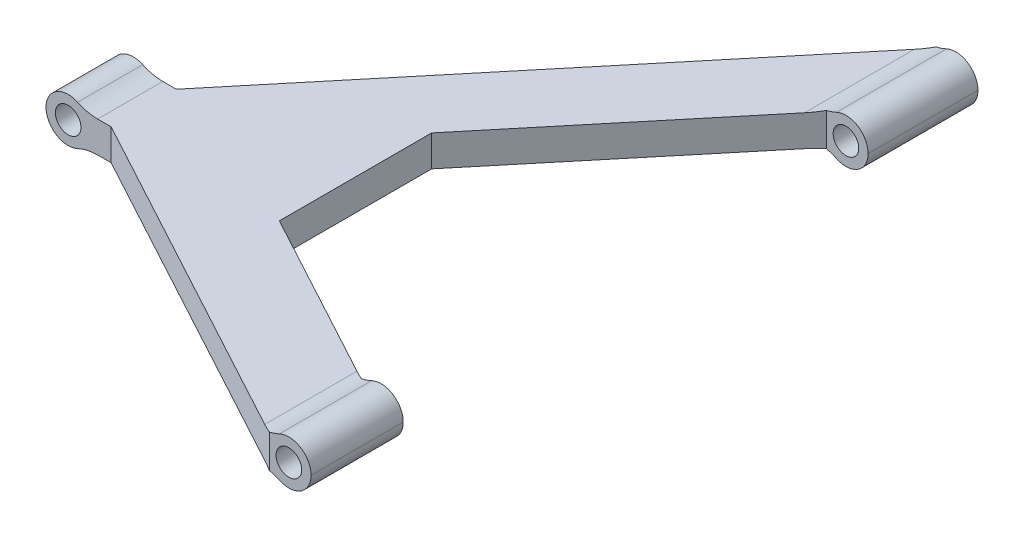
ISO-10303-21;
HEADER;
FILE_DESCRIPTION(('STEP AP214'),'2;1');
FILE_NAME('part.step','',(''),(''),'','','');
FILE_SCHEMA(('AUTOMOTIVE_DESIGN { 1 0 10303 214 1 1 1 1 }'));
ENDSEC;
DATA;
#1=APPLICATION_CONTEXT('core data for automotive mechanical design processes');
#2=APPLICATION_PROTOCOL_DEFINITION('international standard','automotive_design',2000,#1);
#3=PRODUCT_CONTEXT('',#1,'mechanical');
#4=PRODUCT('Part','Part','',(#3));
#5=PRODUCT_RELATED_PRODUCT_CATEGORY('part','',(#4));
#6=PRODUCT_DEFINITION_FORMATION('','',#4);
#7=PRODUCT_DEFINITION_CONTEXT('part definition',#1,'design');
#8=PRODUCT_DEFINITION('design','',#6,#7);
#9=PRODUCT_DEFINITION_SHAPE('','',#8);
#10=(LENGTH_UNIT() NAMED_UNIT(*) SI_UNIT(.MILLI.,.METRE.));
#11=(NAMED_UNIT(*) PLANE_ANGLE_UNIT() SI_UNIT($,.RADIAN.));
#12=(NAMED_UNIT(*) SI_UNIT($,.STERADIAN.) SOLID_ANGLE_UNIT());
#13=UNCERTAINTY_MEASURE_WITH_UNIT(LENGTH_MEASURE(1.E-05),#10,'distance_accuracy_value','');
#14=(GEOMETRIC_REPRESENTATION_CONTEXT(3) GLOBAL_UNCERTAINTY_ASSIGNED_CONTEXT((#13)) GLOBAL_UNIT_ASSIGNED_CONTEXT((#10,
#11,#12)) REPRESENTATION_CONTEXT('',''));
#15=CARTESIAN_POINT('',(0.,0.,0.));
#16=DIRECTION('',(0.,0.,1.));
#17=DIRECTION('',(1.,0.,0.));
#18=AXIS2_PLACEMENT_3D('',#15,#16,#17);
#19=CARTESIAN_POINT('',(0.,-2.38125,29.7610065716251));
#20=DIRECTION('',(0.,0.,1.));
#21=DIRECTION('',(1.,0.,0.));
#22=AXIS2_PLACEMENT_3D('',#19,#20,#21);
#23=PLANE('',#22);
#24=CARTESIAN_POINT('',(2.10785852839907,0.,29.7610065716251));
#25=DIRECTION('',(0.,0.,1.));
#26=DIRECTION('',(1.,0.,0.));
#27=AXIS2_PLACEMENT_3D('',#24,#25,#26);
#28=CIRCLE('',#27,2.38125);
#29=CARTESIAN_POINT('',(4.48910852839907,0.,29.7610065716251));
#30=VERTEX_POINT('',#29);
#31=CARTESIAN_POINT('',(1.09450968814982,2.15487254622298,29.7610065716251));
#32=VERTEX_POINT('',#31);
#33=EDGE_CURVE('E188',#30,#32,#28,.T.);
#34=ORIENTED_EDGE('',*,*,#33,.T.);
#35=CARTESIAN_POINT('',(-1.05999838574963,6.73640470440826,29.7610065716251));
#36=DIRECTION('',(0.,0.,1.));
#37=DIRECTION('',(-1.,0.,0.));
#38=AXIS2_PLACEMENT_3D('',#35,#36,#37);
#39=CIRCLE('',#38,5.06283931771331);
#40=CARTESIAN_POINT('',(0.,1.78577389821881,29.7610065716251));
#41=VERTEX_POINT('',#40);
#42=EDGE_CURVE('E193',#41,#32,#39,.T.);
#43=ORIENTED_EDGE('',*,*,#42,.F.);
#44=DIRECTION('',(0.,1.,0.));
#45=VECTOR('',#44,1.);
#46=CARTESIAN_POINT('',(0.,-2.38125,29.7610065716251));
#47=LINE('',#46,#45);
#48=CARTESIAN_POINT('',(0.,-1.78577389821882,29.7610065716251));
#49=VERTEX_POINT('',#48);
#50=EDGE_CURVE('E314',#49,#41,#47,.T.);
#51=ORIENTED_EDGE('',*,*,#50,.F.);
#52=CARTESIAN_POINT('',(-1.05999838574963,-6.73640470440826,29.7610065716251));
#53=DIRECTION('',(0.,0.,1.));
#54=DIRECTION('',(1.,0.,0.));
#55=AXIS2_PLACEMENT_3D('',#52,#53,#54);
#56=CIRCLE('',#55,5.06283931771331);
#57=CARTESIAN_POINT('',(1.09450968814982,-2.15487254622298,29.7610065716251));
#58=VERTEX_POINT('',#57);
#59=EDGE_CURVE('E253',#58,#49,#56,.T.);
#60=ORIENTED_EDGE('',*,*,#59,.F.);
#61=CARTESIAN_POINT('',(2.10785852839907,0.,29.7610065716251));
#62=DIRECTION('',(0.,0.,1.));
#63=DIRECTION('',(1.,0.,0.));
#64=AXIS2_PLACEMENT_3D('',#61,#62,#63);
#65=CIRCLE('',#64,2.38125);
#66=EDGE_CURVE('E196',#58,#30,#65,.T.);
#67=ORIENTED_EDGE('',*,*,#66,.T.);
#68=EDGE_LOOP('',(#34,#43,#51,#60,#67));
#69=FACE_BOUND('',#68,.T.);
#70=CARTESIAN_POINT('',(2.10785852839906,0.,29.7610065716251));
#71=DIRECTION('',(0.,0.,1.));
#72=DIRECTION('',(1.,0.,0.));
#73=AXIS2_PLACEMENT_3D('',#70,#71,#72);
#74=CIRCLE('',#73,1.375);
#75=CARTESIAN_POINT('',(3.48285852839906,0.,29.7610065716251));
#76=VERTEX_POINT('',#75);
#77=EDGE_CURVE('E298',#76,#76,#74,.T.);
#78=ORIENTED_EDGE('',*,*,#77,.F.);
#79=EDGE_LOOP('',(#78));
#80=FACE_BOUND('',#79,.T.);
#81=ADVANCED_FACE('F33',(#69,#80),#23,.T.);
#82=CARTESIAN_POINT('',(-37.,-2.38125,9.75000000000001));
#83=DIRECTION('',(-0.475719514626919,0.,0.879597034671632));
#84=DIRECTION('',(0.879597034671632,0.,0.475719514626919));
#85=AXIS2_PLACEMENT_3D('',#82,#83,#84);
#86=PLANE('',#85);
#87=CARTESIAN_POINT('',(-1.05999838574963,6.73640470440826,29.1877191482968));
#88=DIRECTION('',(-0.475719514626919,0.,0.879597034671632));
#89=DIRECTION('',(0.879597034671632,0.,0.475719514626919));
#90=AXIS2_PLACEMENT_3D('',#87,#88,#89);
#91=ELLIPSE('',#90,5.75586219387762,5.06283931771331);
#92=CARTESIAN_POINT('',(-1.05999838574962,1.67356538669495,29.1877191482968));
#93=VERTEX_POINT('',#92);
#94=EDGE_CURVE('E214',#93,#41,#91,.T.);
#95=ORIENTED_EDGE('',*,*,#94,.F.);
#96=DIRECTION('',(0.879597034671632,0.,0.475719514626919));
#97=VECTOR('',#96,1.);
#98=CARTESIAN_POINT('',(-37.,1.67356538669495,9.75000000000001));
#99=LINE('',#98,#97);
#100=CARTESIAN_POINT('',(-37.,1.67356538669495,9.75000000000001));
#101=VERTEX_POINT('',#100);
#102=EDGE_CURVE('E249',#101,#93,#99,.T.);
#103=ORIENTED_EDGE('',*,*,#102,.F.);
#104=DIRECTION('',(0.,1.,0.));
#105=VECTOR('',#104,1.);
#106=CARTESIAN_POINT('',(-37.,-2.38125,9.75000000000001));
#107=LINE('',#106,#105);
#108=CARTESIAN_POINT('',(-37.,-1.67356538669495,9.75000000000001));
#109=VERTEX_POINT('',#108);
#110=EDGE_CURVE('E317',#109,#101,#107,.T.);
#111=ORIENTED_EDGE('',*,*,#110,.F.);
#112=DIRECTION('',(-0.879597034671632,0.,-0.475719514626919));
#113=VECTOR('',#112,1.);
#114=CARTESIAN_POINT('',(-37.,-1.67356538669495,9.75000000000001));
#115=LINE('',#114,#113);
#116=CARTESIAN_POINT('',(-1.05999838574963,-1.67356538669495,29.1877191482968));
#117=VERTEX_POINT('',#116);
#118=EDGE_CURVE('E292',#117,#109,#115,.T.);
#119=ORIENTED_EDGE('',*,*,#118,.F.);
#120=CARTESIAN_POINT('',(-1.05999838574963,-6.73640470440826,29.1877191482968));
#121=DIRECTION('',(-0.475719514626919,0.,0.879597034671632));
#122=DIRECTION('',(0.879597034671632,0.,0.475719514626919));
#123=AXIS2_PLACEMENT_3D('',#120,#121,#122);
#124=ELLIPSE('',#123,5.75586219387762,5.06283931771331);
#125=EDGE_CURVE('E280',#49,#117,#124,.T.);
#126=ORIENTED_EDGE('',*,*,#125,.F.);
#127=ORIENTED_EDGE('',*,*,#50,.T.);
#128=EDGE_LOOP('',(#95,#103,#111,#119,#126,#127));
#129=FACE_BOUND('',#128,.T.);
#130=ADVANCED_FACE('F398',(#129),#86,.T.);
#131=CARTESIAN_POINT('',(-44.,-2.38125,9.75000000000001));
#132=DIRECTION('',(0.,0.,1.));
#133=DIRECTION('',(1.,0.,0.));
#134=AXIS2_PLACEMENT_3D('',#131,#132,#133);
#135=PLANE('',#134);
#136=DIRECTION('',(1.,0.,0.));
#137=VECTOR('',#136,1.);
#138=CARTESIAN_POINT('',(-44.,1.67356538669495,9.75000000000001));
#139=LINE('',#138,#137);
#140=CARTESIAN_POINT('',(-38.4508930858513,1.67356538669495,9.75000000000001));
#141=VERTEX_POINT('',#140);
#142=EDGE_CURVE('E247',#141,#101,#139,.T.);
#143=ORIENTED_EDGE('',*,*,#142,.F.);
#144=CARTESIAN_POINT('',(-38.4508930858513,6.73640470440826,9.75000000000001));
#145=DIRECTION('',(0.,0.,1.));
#146=DIRECTION('',(1.,0.,0.));
#147=AXIS2_PLACEMENT_3D('',#144,#145,#146);
#148=CIRCLE('',#147,5.06283931771331);
#149=CARTESIAN_POINT('',(-40.6054011597508,2.15487254622298,9.75000000000001));
#150=VERTEX_POINT('',#149);
#151=EDGE_CURVE('E251',#150,#141,#148,.T.);
#152=ORIENTED_EDGE('',*,*,#151,.F.);
#153=CARTESIAN_POINT('',(-41.61875,0.,9.75000000000001));
#154=DIRECTION('',(0.,0.,1.));
#155=DIRECTION('',(1.,0.,0.));
#156=AXIS2_PLACEMENT_3D('',#153,#154,#155);
#157=CIRCLE('',#156,2.38125);
#158=CARTESIAN_POINT('',(-44.,0.,9.75000000000001));
#159=VERTEX_POINT('',#158);
#160=EDGE_CURVE('E56',#150,#159,#157,.T.);
#161=ORIENTED_EDGE('',*,*,#160,.T.);
#162=CARTESIAN_POINT('',(-41.61875,0.,9.75000000000001));
#163=DIRECTION('',(0.,0.,1.));
#164=DIRECTION('',(1.,0.,0.));
#165=AXIS2_PLACEMENT_3D('',#162,#163,#164);
#166=CIRCLE('',#165,2.38125);
#167=CARTESIAN_POINT('',(-40.6054011597508,-2.15487254622298,9.75000000000001));
#168=VERTEX_POINT('',#167);
#169=EDGE_CURVE('E352',#159,#168,#166,.T.);
#170=ORIENTED_EDGE('',*,*,#169,.T.);
#171=CARTESIAN_POINT('',(-38.4508930858513,-6.73640470440826,9.75000000000001));
#172=DIRECTION('',(0.,0.,1.));
#173=DIRECTION('',(1.,0.,0.));
#174=AXIS2_PLACEMENT_3D('',#171,#172,#173);
#175=CIRCLE('',#174,5.06283931771331);
#176=CARTESIAN_POINT('',(-38.4508930858513,-1.67356538669495,9.75000000000001));
#177=VERTEX_POINT('',#176);
#178=EDGE_CURVE('E294',#177,#168,#175,.T.);
#179=ORIENTED_EDGE('',*,*,#178,.F.);
#180=DIRECTION('',(-1.,0.,0.));
#181=VECTOR('',#180,1.);
#182=CARTESIAN_POINT('',(-44.,-1.67356538669495,9.75000000000001));
#183=LINE('',#182,#181);
#184=EDGE_CURVE('E290',#109,#177,#183,.T.);
#185=ORIENTED_EDGE('',*,*,#184,.F.);
#186=ORIENTED_EDGE('',*,*,#110,.T.);
#187=EDGE_LOOP('',(#143,#152,#161,#170,#179,#185,#186));
#188=FACE_BOUND('',#187,.T.);
#189=CARTESIAN_POINT('',(-41.61875,0.,9.75000000000001));
#190=DIRECTION('',(0.,0.,1.));
#191=DIRECTION('',(1.,0.,0.));
#192=AXIS2_PLACEMENT_3D('',#189,#190,#191);
#193=CIRCLE('',#192,1.375);
#194=CARTESIAN_POINT('',(-40.24375,0.,9.75000000000001));
#195=VERTEX_POINT('',#194);
#196=EDGE_CURVE('E310',#195,#195,#193,.T.);
#197=ORIENTED_EDGE('',*,*,#196,.F.);
#198=EDGE_LOOP('',(#197));
#199=FACE_BOUND('',#198,.T.);
#200=ADVANCED_FACE('F405',(#188,#199),#135,.T.);
#201=CARTESIAN_POINT('',(-37.,-2.38125,2.75));
#202=DIRECTION('',(0.,0.,-1.));
#203=DIRECTION('',(-1.,0.,0.));
#204=AXIS2_PLACEMENT_3D('',#201,#202,#203);
#205=PLANE('',#204);
#206=DIRECTION('',(-1.,0.,0.));
#207=VECTOR('',#206,1.);
#208=CARTESIAN_POINT('',(-37.,1.67356538669495,2.75));
#209=LINE('',#208,#207);
#210=CARTESIAN_POINT('',(-37.,1.67356538669495,2.75));
#211=VERTEX_POINT('',#210);
#212=CARTESIAN_POINT('',(-38.4508930858513,1.67356538669495,2.75));
#213=VERTEX_POINT('',#212);
#214=EDGE_CURVE('E245',#211,#213,#209,.T.);
#215=ORIENTED_EDGE('',*,*,#214,.F.);
#216=DIRECTION('',(0.,1.,0.));
#217=VECTOR('',#216,1.);
#218=CARTESIAN_POINT('',(-37.,-2.38125,2.75));
#219=LINE('',#218,#217);
#220=CARTESIAN_POINT('',(-37.,-1.67356538669495,2.75));
#221=VERTEX_POINT('',#220);
#222=EDGE_CURVE('E320',#221,#211,#219,.T.);
#223=ORIENTED_EDGE('',*,*,#222,.F.);
#224=DIRECTION('',(1.,0.,0.));
#225=VECTOR('',#224,1.);
#226=CARTESIAN_POINT('',(-37.,-1.67356538669495,2.75));
#227=LINE('',#226,#225);
#228=CARTESIAN_POINT('',(-38.4508930858513,-1.67356538669495,2.75));
#229=VERTEX_POINT('',#228);
#230=EDGE_CURVE('E288',#229,#221,#227,.T.);
#231=ORIENTED_EDGE('',*,*,#230,.F.);
#232=CARTESIAN_POINT('',(-38.4508930858513,-6.73640470440826,2.75));
#233=DIRECTION('',(0.,0.,-1.));
#234=DIRECTION('',(-1.,0.,0.));
#235=AXIS2_PLACEMENT_3D('',#232,#233,#234);
#236=CIRCLE('',#235,5.06283931771331);
#237=CARTESIAN_POINT('',(-40.6054011597508,-2.15487254622298,2.75));
#238=VERTEX_POINT('',#237);
#239=EDGE_CURVE('E368',#238,#229,#236,.T.);
#240=ORIENTED_EDGE('',*,*,#239,.F.);
#241=CARTESIAN_POINT('',(-41.61875,0.,2.75));
#242=DIRECTION('',(0.,0.,-1.));
#243=DIRECTION('',(-1.,0.,0.));
#244=AXIS2_PLACEMENT_3D('',#241,#242,#243);
#245=CIRCLE('',#244,2.38125);
#246=CARTESIAN_POINT('',(-44.,0.,2.75));
#247=VERTEX_POINT('',#246);
#248=EDGE_CURVE('E48',#238,#247,#245,.T.);
#249=ORIENTED_EDGE('',*,*,#248,.T.);
#250=CARTESIAN_POINT('',(-41.61875,0.,2.75));
#251=DIRECTION('',(0.,0.,-1.));
#252=DIRECTION('',(-1.,0.,0.));
#253=AXIS2_PLACEMENT_3D('',#250,#251,#252);
#254=CIRCLE('',#253,2.38125);
#255=CARTESIAN_POINT('',(-40.6054011597508,2.15487254622298,2.75));
#256=VERTEX_POINT('',#255);
#257=EDGE_CURVE('E354',#247,#256,#254,.T.);
#258=ORIENTED_EDGE('',*,*,#257,.T.);
#259=CARTESIAN_POINT('',(-38.4508930858513,6.73640470440826,2.75));
#260=DIRECTION('',(0.,0.,-1.));
#261=DIRECTION('',(-1.,0.,0.));
#262=AXIS2_PLACEMENT_3D('',#259,#260,#261);
#263=CIRCLE('',#262,5.06283931771331);
#264=EDGE_CURVE('E11',#213,#256,#263,.T.);
#265=ORIENTED_EDGE('',*,*,#264,.F.);
#266=EDGE_LOOP('',(#215,#223,#231,#240,#249,#258,#265));
#267=FACE_BOUND('',#266,.T.);
#268=CARTESIAN_POINT('',(-41.61875,0.,2.75));
#269=DIRECTION('',(0.,0.,-1.));
#270=DIRECTION('',(-1.,0.,0.));
#271=AXIS2_PLACEMENT_3D('',#268,#269,#270);
#272=CIRCLE('',#271,1.375);
#273=CARTESIAN_POINT('',(-42.99375,0.,2.75));
#274=VERTEX_POINT('',#273);
#275=EDGE_CURVE('E309',#274,#274,#272,.T.);
#276=ORIENTED_EDGE('',*,*,#275,.F.);
#277=EDGE_LOOP('',(#276));
#278=FACE_BOUND('',#277,.T.);
#279=ADVANCED_FACE('F417',(#267,#278),#205,.T.);
#280=CARTESIAN_POINT('',(0.,-2.38125,-41.8989934283749));
#281=DIRECTION('',(-0.769978183116438,0.,-0.638070213632253));
#282=DIRECTION('',(-0.638070213632253,0.,0.769978183116438));
#283=AXIS2_PLACEMENT_3D('',#280,#281,#282);
#284=PLANE('',#283);
#285=CARTESIAN_POINT('',(-1.05999838574963,6.73640470440826,-40.6198620510932));
#286=DIRECTION('',(-0.769978183116438,0.,-0.638070213632253));
#287=DIRECTION('',(-0.638070213632253,0.,0.769978183116438));
#288=AXIS2_PLACEMENT_3D('',#285,#286,#287);
#289=ELLIPSE('',#288,7.93461159845215,5.06283931771331);
#290=CARTESIAN_POINT('',(0.,1.78577389821881,-41.8989934283749));
#291=VERTEX_POINT('',#290);
#292=CARTESIAN_POINT('',(-1.05999838574963,1.67356538669495,-40.6198620510932));
#293=VERTEX_POINT('',#292);
#294=EDGE_CURVE('E236',#291,#293,#289,.T.);
#295=ORIENTED_EDGE('',*,*,#294,.F.);
#296=DIRECTION('',(0.,1.,0.));
#297=VECTOR('',#296,1.);
#298=CARTESIAN_POINT('',(0.,-2.38125,-41.8989934283749));
#299=LINE('',#298,#297);
#300=CARTESIAN_POINT('',(0.,-1.78577389821882,-41.8989934283749));
#301=VERTEX_POINT('',#300);
#302=EDGE_CURVE('E323',#301,#291,#299,.T.);
#303=ORIENTED_EDGE('',*,*,#302,.F.);
#304=CARTESIAN_POINT('',(-1.05999838574963,-6.73640470440826,-40.6198620510932));
#305=DIRECTION('',(-0.769978183116438,0.,-0.638070213632253));
#306=DIRECTION('',(-0.638070213632253,0.,0.769978183116438));
#307=AXIS2_PLACEMENT_3D('',#304,#305,#306);
#308=ELLIPSE('',#307,7.93461159845214,5.06283931771331);
#309=CARTESIAN_POINT('',(-1.05999838574963,-1.67356538669495,-40.6198620510932));
#310=VERTEX_POINT('',#309);
#311=EDGE_CURVE('E278',#310,#301,#308,.T.);
#312=ORIENTED_EDGE('',*,*,#311,.F.);
#313=DIRECTION('',(0.638070213632253,0.,-0.769978183116438));
#314=VECTOR('',#313,1.);
#315=CARTESIAN_POINT('',(0.,-1.67356538669495,-41.8989934283749));
#316=LINE('',#315,#314);
#317=EDGE_CURVE('E286',#221,#310,#316,.T.);
#318=ORIENTED_EDGE('',*,*,#317,.F.);
#319=ORIENTED_EDGE('',*,*,#222,.T.);
#320=DIRECTION('',(-0.638070213632253,0.,0.769978183116438));
#321=VECTOR('',#320,1.);
#322=CARTESIAN_POINT('',(0.,1.67356538669495,-41.8989934283749));
#323=LINE('',#322,#321);
#324=EDGE_CURVE('E243',#293,#211,#323,.T.);
#325=ORIENTED_EDGE('',*,*,#324,.F.);
#326=EDGE_LOOP('',(#295,#303,#312,#318,#319,#325));
#327=FACE_BOUND('',#326,.T.);
#328=ADVANCED_FACE('F429',(#327),#284,.T.);
#329=CARTESIAN_POINT('',(4.48910852839907,-2.38125,-41.8989934283749));
#330=DIRECTION('',(0.,0.,-1.));
#331=DIRECTION('',(-1.,0.,0.));
#332=AXIS2_PLACEMENT_3D('',#329,#330,#331);
#333=PLANE('',#332);
#334=CARTESIAN_POINT('',(-1.05999838574963,6.73640470440826,-41.8989934283749));
#335=DIRECTION('',(0.,0.,1.));
#336=DIRECTION('',(-1.,0.,0.));
#337=AXIS2_PLACEMENT_3D('',#334,#335,#336);
#338=CIRCLE('',#337,5.06283931771331);
#339=CARTESIAN_POINT('',(1.09450968814982,2.15487254622298,-41.8989934283749));
#340=VERTEX_POINT('',#339);
#341=EDGE_CURVE('E215',#291,#340,#338,.T.);
#342=ORIENTED_EDGE('',*,*,#341,.T.);
#343=CARTESIAN_POINT('',(2.10785852839907,0.,-41.8989934283749));
#344=DIRECTION('',(0.,0.,-1.));
#345=DIRECTION('',(-1.,0.,0.));
#346=AXIS2_PLACEMENT_3D('',#343,#344,#345);
#347=CIRCLE('',#346,2.38125);
#348=CARTESIAN_POINT('',(4.48910852839907,0.,-41.8989934283749));
#349=VERTEX_POINT('',#348);
#350=EDGE_CURVE('E342',#340,#349,#347,.T.);
#351=ORIENTED_EDGE('',*,*,#350,.T.);
#352=CARTESIAN_POINT('',(2.10785852839907,0.,-41.8989934283749));
#353=DIRECTION('',(0.,0.,-1.));
#354=DIRECTION('',(-1.,0.,0.));
#355=AXIS2_PLACEMENT_3D('',#352,#353,#354);
#356=CIRCLE('',#355,2.38125);
#357=CARTESIAN_POINT('',(1.09450968814982,-2.15487254622298,-41.8989934283749));
#358=VERTEX_POINT('',#357);
#359=EDGE_CURVE('E316',#349,#358,#356,.T.);
#360=ORIENTED_EDGE('',*,*,#359,.T.);
#361=CARTESIAN_POINT('',(-1.05999838574963,-6.73640470440826,-41.8989934283749));
#362=DIRECTION('',(0.,0.,1.));
#363=DIRECTION('',(1.,0.,0.));
#364=AXIS2_PLACEMENT_3D('',#361,#362,#363);
#365=CIRCLE('',#364,5.06283931771331);
#366=EDGE_CURVE('E255',#358,#301,#365,.T.);
#367=ORIENTED_EDGE('',*,*,#366,.T.);
#368=ORIENTED_EDGE('',*,*,#302,.T.);
#369=EDGE_LOOP('',(#342,#351,#360,#367,#368));
#370=FACE_BOUND('',#369,.T.);
#371=CARTESIAN_POINT('',(2.10785852839906,0.,-41.8989934283749));
#372=DIRECTION('',(0.,0.,1.));
#373=DIRECTION('',(1.,0.,0.));
#374=AXIS2_PLACEMENT_3D('',#371,#372,#373);
#375=CIRCLE('',#374,1.375);
#376=CARTESIAN_POINT('',(3.48285852839906,0.,-41.8989934283749));
#377=VERTEX_POINT('',#376);
#378=EDGE_CURVE('E301',#377,#377,#375,.T.);
#379=ORIENTED_EDGE('',*,*,#378,.T.);
#380=EDGE_LOOP('',(#379));
#381=FACE_BOUND('',#380,.T.);
#382=ADVANCED_FACE('F458',(#370,#381),#333,.T.);
#383=CARTESIAN_POINT('',(0.,-2.38125,-30.0914388092927));
#384=DIRECTION('',(0.,0.,1.));
#385=DIRECTION('',(1.,0.,0.));
#386=AXIS2_PLACEMENT_3D('',#383,#384,#385);
#387=PLANE('',#386);
#388=CARTESIAN_POINT('',(2.10785852839907,0.,-30.0914388092927));
#389=DIRECTION('',(0.,0.,1.));
#390=DIRECTION('',(1.,0.,0.));
#391=AXIS2_PLACEMENT_3D('',#388,#389,#390);
#392=CIRCLE('',#391,2.38125);
#393=CARTESIAN_POINT('',(4.48910852839907,0.,-30.0914388092927));
#394=VERTEX_POINT('',#393);
#395=CARTESIAN_POINT('',(1.09450968814982,2.15487254622298,-30.0914388092927));
#396=VERTEX_POINT('',#395);
#397=EDGE_CURVE('E346',#394,#396,#392,.T.);
#398=ORIENTED_EDGE('',*,*,#397,.T.);
#399=CARTESIAN_POINT('',(-1.05999838574963,6.73640470440826,-30.0914388092927));
#400=DIRECTION('',(0.,0.,1.));
#401=DIRECTION('',(1.,0.,0.));
#402=AXIS2_PLACEMENT_3D('',#399,#400,#401);
#403=CIRCLE('',#402,5.06283931771331);
#404=CARTESIAN_POINT('',(0.,1.78577389821881,-30.0914388092927));
#405=VERTEX_POINT('',#404);
#406=EDGE_CURVE('E233',#405,#396,#403,.T.);
#407=ORIENTED_EDGE('',*,*,#406,.F.);
#408=DIRECTION('',(0.,1.,0.));
#409=VECTOR('',#408,1.);
#410=CARTESIAN_POINT('',(0.,-2.38125,-30.0914388092927));
#411=LINE('',#410,#409);
#412=CARTESIAN_POINT('',(0.,-1.78577389821881,-30.0914388092927));
#413=VERTEX_POINT('',#412);
#414=EDGE_CURVE('E326',#413,#405,#411,.T.);
#415=ORIENTED_EDGE('',*,*,#414,.F.);
#416=CARTESIAN_POINT('',(-1.05999838574963,-6.73640470440826,-30.0914388092927));
#417=DIRECTION('',(0.,0.,1.));
#418=DIRECTION('',(1.,0.,0.));
#419=AXIS2_PLACEMENT_3D('',#416,#417,#418);
#420=CIRCLE('',#419,5.06283931771331);
#421=CARTESIAN_POINT('',(1.09450968814982,-2.15487254622298,-30.0914388092927));
#422=VERTEX_POINT('',#421);
#423=EDGE_CURVE('E276',#422,#413,#420,.T.);
#424=ORIENTED_EDGE('',*,*,#423,.F.);
#425=CARTESIAN_POINT('',(2.10785852839907,0.,-30.0914388092927));
#426=DIRECTION('',(0.,0.,1.));
#427=DIRECTION('',(1.,0.,0.));
#428=AXIS2_PLACEMENT_3D('',#425,#426,#427);
#429=CIRCLE('',#428,2.38125);
#430=EDGE_CURVE('E344',#422,#394,#429,.T.);
#431=ORIENTED_EDGE('',*,*,#430,.T.);
#432=EDGE_LOOP('',(#398,#407,#415,#424,#431));
#433=FACE_BOUND('',#432,.T.);
#434=CARTESIAN_POINT('',(2.10785852839906,0.,-30.0914388092927));
#435=DIRECTION('',(0.,0.,1.));
#436=DIRECTION('',(1.,0.,0.));
#437=AXIS2_PLACEMENT_3D('',#434,#435,#436);
#438=CIRCLE('',#437,1.375);
#439=CARTESIAN_POINT('',(3.48285852839906,0.,-30.0914388092927));
#440=VERTEX_POINT('',#439);
#441=EDGE_CURVE('E306',#440,#440,#438,.T.);
#442=ORIENTED_EDGE('',*,*,#441,.F.);
#443=EDGE_LOOP('',(#442));
#444=FACE_BOUND('',#443,.T.);
#445=ADVANCED_FACE('F446',(#433,#444),#387,.T.);
#446=CARTESIAN_POINT('',(-19.2165208379403,-2.38125,-6.90229522525416));
#447=DIRECTION('',(0.769978183116438,0.,0.638070213632253));
#448=DIRECTION('',(0.638070213632253,0.,-0.769978183116439));
#449=AXIS2_PLACEMENT_3D('',#446,#447,#448);
#450=PLANE('',#449);
#451=CARTESIAN_POINT('',(-1.05999838574963,6.73640470440826,-28.812307432011));
#452=DIRECTION('',(0.769978183116438,0.,0.638070213632253));
#453=DIRECTION('',(-0.638070213632253,0.,0.769978183116439));
#454=AXIS2_PLACEMENT_3D('',#451,#452,#453);
#455=ELLIPSE('',#454,7.93461159845215,5.06283931771331);
#456=CARTESIAN_POINT('',(-1.05999838574961,1.67356538669495,-28.812307432011));
#457=VERTEX_POINT('',#456);
#458=EDGE_CURVE('E231',#457,#405,#455,.T.);
#459=ORIENTED_EDGE('',*,*,#458,.F.);
#460=DIRECTION('',(0.638070213632253,0.,-0.769978183116439));
#461=VECTOR('',#460,1.);
#462=CARTESIAN_POINT('',(-19.2165208379403,1.67356538669495,-6.90229522525416));
#463=LINE('',#462,#461);
#464=CARTESIAN_POINT('',(-19.2165208379403,1.67356538669495,-6.90229522525416));
#465=VERTEX_POINT('',#464);
#466=EDGE_CURVE('E241',#465,#457,#463,.T.);
#467=ORIENTED_EDGE('',*,*,#466,.F.);
#468=DIRECTION('',(0.,1.,0.));
#469=VECTOR('',#468,1.);
#470=CARTESIAN_POINT('',(-19.2165208379403,-2.38125,-6.90229522525416));
#471=LINE('',#470,#469);
#472=CARTESIAN_POINT('',(-19.2165208379403,-1.67356538669495,-6.90229522525416));
#473=VERTEX_POINT('',#472);
#474=EDGE_CURVE('E329',#473,#465,#471,.T.);
#475=ORIENTED_EDGE('',*,*,#474,.F.);
#476=DIRECTION('',(-0.638070213632253,0.,0.769978183116439));
#477=VECTOR('',#476,1.);
#478=CARTESIAN_POINT('',(-19.2165208379403,-1.67356538669495,-6.90229522525416));
#479=LINE('',#478,#477);
#480=CARTESIAN_POINT('',(-1.05999838574963,-1.67356538669495,-28.812307432011));
#481=VERTEX_POINT('',#480);
#482=EDGE_CURVE('E284',#481,#473,#479,.T.);
#483=ORIENTED_EDGE('',*,*,#482,.F.);
#484=CARTESIAN_POINT('',(-1.05999838574963,-6.73640470440826,-28.812307432011));
#485=DIRECTION('',(0.769978183116438,0.,0.638070213632253));
#486=DIRECTION('',(-0.638070213632253,0.,0.769978183116439));
#487=AXIS2_PLACEMENT_3D('',#484,#485,#486);
#488=ELLIPSE('',#487,7.93461159845215,5.06283931771331);
#489=EDGE_CURVE('E274',#413,#481,#488,.T.);
#490=ORIENTED_EDGE('',*,*,#489,.F.);
#491=ORIENTED_EDGE('',*,*,#414,.T.);
#492=EDGE_LOOP('',(#459,#467,#475,#483,#490,#491));
#493=FACE_BOUND('',#492,.T.);
#494=ADVANCED_FACE('F443',(#493),#450,.T.);
#495=CARTESIAN_POINT('',(-19.2165208379403,-2.38125,9.4610649423477));
#496=DIRECTION('',(1.,0.,0.));
#497=DIRECTION('',(0.,0.,-1.));
#498=AXIS2_PLACEMENT_3D('',#495,#496,#497);
#499=PLANE('',#498);
#500=DIRECTION('',(0.,0.,-1.));
#501=VECTOR('',#500,1.);
#502=CARTESIAN_POINT('',(-19.2165208379403,1.67356538669495,9.4610649423477));
#503=LINE('',#502,#501);
#504=CARTESIAN_POINT('',(-19.2165208379403,1.67356538669495,9.4610649423477));
#505=VERTEX_POINT('',#504);
#506=EDGE_CURVE('E239',#505,#465,#503,.T.);
#507=ORIENTED_EDGE('',*,*,#506,.F.);
#508=DIRECTION('',(0.,1.,0.));
#509=VECTOR('',#508,1.);
#510=CARTESIAN_POINT('',(-19.2165208379403,-2.38125,9.4610649423477));
#511=LINE('',#510,#509);
#512=CARTESIAN_POINT('',(-19.2165208379403,-1.67356538669495,9.4610649423477));
#513=VERTEX_POINT('',#512);
#514=EDGE_CURVE('E332',#513,#505,#511,.T.);
#515=ORIENTED_EDGE('',*,*,#514,.F.);
#516=DIRECTION('',(0.,0.,1.));
#517=VECTOR('',#516,1.);
#518=CARTESIAN_POINT('',(-19.2165208379403,-1.67356538669495,9.4610649423477));
#519=LINE('',#518,#517);
#520=EDGE_CURVE('E282',#473,#513,#519,.T.);
#521=ORIENTED_EDGE('',*,*,#520,.F.);
#522=ORIENTED_EDGE('',*,*,#474,.T.);
#523=EDGE_LOOP('',(#507,#515,#521,#522));
#524=FACE_BOUND('',#523,.T.);
#525=ADVANCED_FACE('F381',(#524),#499,.T.);
#526=CARTESIAN_POINT('',(0.,-2.38125,19.85408993618));
#527=DIRECTION('',(0.475719514626919,0.,-0.879597034671632));
#528=DIRECTION('',(-0.879597034671633,0.,-0.475719514626919));
#529=AXIS2_PLACEMENT_3D('',#526,#527,#528);
#530=PLANE('',#529);
#531=CARTESIAN_POINT('',(-1.05999838574963,6.73640470440826,19.2808025128517));
#532=DIRECTION('',(0.475719514626919,0.,-0.879597034671632));
#533=DIRECTION('',(0.879597034671633,0.,0.475719514626919));
#534=AXIS2_PLACEMENT_3D('',#531,#532,#533);
#535=ELLIPSE('',#534,5.75586219387762,5.06283931771331);
#536=CARTESIAN_POINT('',(0.,1.78577389821882,19.85408993618));
#537=VERTEX_POINT('',#536);
#538=CARTESIAN_POINT('',(-1.05999838574963,1.67356538669495,19.2808025128516));
#539=VERTEX_POINT('',#538);
#540=EDGE_CURVE('E222',#537,#539,#535,.T.);
#541=ORIENTED_EDGE('',*,*,#540,.F.);
#542=DIRECTION('',(0.,1.,0.));
#543=VECTOR('',#542,1.);
#544=CARTESIAN_POINT('',(0.,-2.38125,19.85408993618));
#545=LINE('',#544,#543);
#546=CARTESIAN_POINT('',(0.,-1.78577389821882,19.85408993618));
#547=VERTEX_POINT('',#546);
#548=EDGE_CURVE('E313',#547,#537,#545,.T.);
#549=ORIENTED_EDGE('',*,*,#548,.F.);
#550=CARTESIAN_POINT('',(-1.05999838574963,-6.73640470440826,19.2808025128517));
#551=DIRECTION('',(0.475719514626919,0.,-0.879597034671632));
#552=DIRECTION('',(0.879597034671633,0.,0.475719514626919));
#553=AXIS2_PLACEMENT_3D('',#550,#551,#552);
#554=ELLIPSE('',#553,5.75586219387762,5.06283931771331);
#555=CARTESIAN_POINT('',(-1.05999838574963,-1.67356538669495,19.2808025128517));
#556=VERTEX_POINT('',#555);
#557=EDGE_CURVE('E262',#556,#547,#554,.T.);
#558=ORIENTED_EDGE('',*,*,#557,.F.);
#559=DIRECTION('',(0.879597034671633,0.,0.475719514626919));
#560=VECTOR('',#559,1.);
#561=CARTESIAN_POINT('',(0.,-1.67356538669495,19.85408993618));
#562=LINE('',#561,#560);
#563=EDGE_CURVE('E366',#513,#556,#562,.T.);
#564=ORIENTED_EDGE('',*,*,#563,.F.);
#565=ORIENTED_EDGE('',*,*,#514,.T.);
#566=DIRECTION('',(-0.879597034671633,0.,-0.475719514626919));
#567=VECTOR('',#566,1.);
#568=CARTESIAN_POINT('',(0.,1.67356538669495,19.85408993618));
#569=LINE('',#568,#567);
#570=EDGE_CURVE('E41',#539,#505,#569,.T.);
#571=ORIENTED_EDGE('',*,*,#570,.F.);
#572=EDGE_LOOP('',(#541,#549,#558,#564,#565,#571));
#573=FACE_BOUND('',#572,.T.);
#574=ADVANCED_FACE('F385',(#573),#530,.T.);
#575=CARTESIAN_POINT('',(4.48910852839907,-2.38125,19.85408993618));
#576=DIRECTION('',(0.,0.,-1.));
#577=DIRECTION('',(-1.,0.,0.));
#578=AXIS2_PLACEMENT_3D('',#575,#576,#577);
#579=PLANE('',#578);
#580=CARTESIAN_POINT('',(-1.05999838574963,6.73640470440826,19.85408993618));
#581=DIRECTION('',(0.,0.,-1.));
#582=DIRECTION('',(-1.,0.,0.));
#583=AXIS2_PLACEMENT_3D('',#580,#581,#582);
#584=CIRCLE('',#583,5.06283931771331);
#585=CARTESIAN_POINT('',(1.09450968814982,2.15487254622298,19.85408993618));
#586=VERTEX_POINT('',#585);
#587=EDGE_CURVE('E370',#586,#537,#584,.T.);
#588=ORIENTED_EDGE('',*,*,#587,.F.);
#589=CARTESIAN_POINT('',(2.10785852839907,0.,19.85408993618));
#590=DIRECTION('',(0.,0.,-1.));
#591=DIRECTION('',(-1.,0.,0.));
#592=AXIS2_PLACEMENT_3D('',#589,#590,#591);
#593=CIRCLE('',#592,2.38125);
#594=CARTESIAN_POINT('',(4.48910852839907,0.,19.85408993618));
#595=VERTEX_POINT('',#594);
#596=EDGE_CURVE('E205',#586,#595,#593,.T.);
#597=ORIENTED_EDGE('',*,*,#596,.T.);
#598=CARTESIAN_POINT('',(2.10785852839907,0.,19.85408993618));
#599=DIRECTION('',(0.,0.,-1.));
#600=DIRECTION('',(-1.,0.,0.));
#601=AXIS2_PLACEMENT_3D('',#598,#599,#600);
#602=CIRCLE('',#601,2.38125);
#603=CARTESIAN_POINT('',(1.09450968814982,-2.15487254622298,19.85408993618));
#604=VERTEX_POINT('',#603);
#605=EDGE_CURVE('E200',#595,#604,#602,.T.);
#606=ORIENTED_EDGE('',*,*,#605,.T.);
#607=CARTESIAN_POINT('',(-1.05999838574963,-6.73640470440826,19.85408993618));
#608=DIRECTION('',(0.,0.,-1.));
#609=DIRECTION('',(-1.,0.,0.));
#610=AXIS2_PLACEMENT_3D('',#607,#608,#609);
#611=CIRCLE('',#610,5.06283931771331);
#612=EDGE_CURVE('E357',#547,#604,#611,.T.);
#613=ORIENTED_EDGE('',*,*,#612,.F.);
#614=ORIENTED_EDGE('',*,*,#548,.T.);
#615=EDGE_LOOP('',(#588,#597,#606,#613,#614));
#616=FACE_BOUND('',#615,.T.);
#617=CARTESIAN_POINT('',(2.10785852839906,0.,19.85408993618));
#618=DIRECTION('',(0.,0.,-1.));
#619=DIRECTION('',(-1.,0.,0.));
#620=AXIS2_PLACEMENT_3D('',#617,#618,#619);
#621=CIRCLE('',#620,1.375);
#622=CARTESIAN_POINT('',(0.73285852839906,0.,19.85408993618));
#623=VERTEX_POINT('',#622);
#624=EDGE_CURVE('E305',#623,#623,#621,.T.);
#625=ORIENTED_EDGE('',*,*,#624,.F.);
#626=EDGE_LOOP('',(#625));
#627=FACE_BOUND('',#626,.T.);
#628=ADVANCED_FACE('F483',(#616,#627),#579,.T.);
#629=CARTESIAN_POINT('',(-41.61875,0.,-41.8989934283749));
#630=DIRECTION('',(0.,0.,1.));
#631=DIRECTION('',(1.,0.,0.));
#632=AXIS2_PLACEMENT_3D('',#629,#630,#631);
#633=CYLINDRICAL_SURFACE('',#632,1.375);
#634=ORIENTED_EDGE('',*,*,#196,.T.);
#635=EDGE_LOOP('',(#634));
#636=FACE_BOUND('',#635,.T.);
#637=ORIENTED_EDGE('',*,*,#275,.T.);
#638=EDGE_LOOP('',(#637));
#639=FACE_BOUND('',#638,.T.);
#640=ADVANCED_FACE('F486',(#636,#639),#633,.F.);
#641=CARTESIAN_POINT('',(2.10785852839906,0.,-41.8989934283749));
#642=DIRECTION('',(0.,0.,1.));
#643=DIRECTION('',(1.,0.,0.));
#644=AXIS2_PLACEMENT_3D('',#641,#642,#643);
#645=CYLINDRICAL_SURFACE('',#644,1.375);
#646=ORIENTED_EDGE('',*,*,#624,.T.);
#647=EDGE_LOOP('',(#646));
#648=FACE_BOUND('',#647,.T.);
#649=ORIENTED_EDGE('',*,*,#77,.T.);
#650=EDGE_LOOP('',(#649));
#651=FACE_BOUND('',#650,.T.);
#652=ADVANCED_FACE('F471',(#648,#651),#645,.F.);
#653=ORIENTED_EDGE('',*,*,#441,.T.);
#654=EDGE_LOOP('',(#653));
#655=FACE_BOUND('',#654,.T.);
#656=ORIENTED_EDGE('',*,*,#378,.F.);
#657=EDGE_LOOP('',(#656));
#658=FACE_BOUND('',#657,.T.);
#659=ADVANCED_FACE('F464',(#655,#658),#645,.F.);
#660=CARTESIAN_POINT('',(2.10785852839907,0.,-30.0914388092927));
#661=DIRECTION('',(0.,0.,1.));
#662=DIRECTION('',(1.,0.,0.));
#663=AXIS2_PLACEMENT_3D('',#660,#661,#662);
#664=CYLINDRICAL_SURFACE('',#663,2.38125);
#665=DIRECTION('',(0.,0.,-1.));
#666=VECTOR('',#665,1.);
#667=CARTESIAN_POINT('',(4.48910852839907,0.,-41.8989934283749));
#668=LINE('',#667,#666);
#669=EDGE_CURVE('E302',#394,#349,#668,.T.);
#670=ORIENTED_EDGE('',*,*,#669,.F.);
#671=ORIENTED_EDGE('',*,*,#430,.F.);
#672=DIRECTION('',(0.,0.,1.));
#673=VECTOR('',#672,1.);
#674=CARTESIAN_POINT('',(1.09450968814982,-2.15487254622298,-41.8989934283749));
#675=LINE('',#674,#673);
#676=EDGE_CURVE('E270',#358,#422,#675,.T.);
#677=ORIENTED_EDGE('',*,*,#676,.F.);
#678=ORIENTED_EDGE('',*,*,#359,.F.);
#679=EDGE_LOOP('',(#670,#671,#677,#678));
#680=FACE_BOUND('',#679,.T.);
#681=ADVANCED_FACE('F462',(#680),#664,.T.);
#682=CARTESIAN_POINT('',(2.10785852839907,0.,29.7610065716251));
#683=DIRECTION('',(0.,0.,-1.));
#684=DIRECTION('',(-1.,0.,0.));
#685=AXIS2_PLACEMENT_3D('',#682,#683,#684);
#686=CYLINDRICAL_SURFACE('',#685,2.38125);
#687=ORIENTED_EDGE('',*,*,#397,.F.);
#688=ORIENTED_EDGE('',*,*,#669,.T.);
#689=ORIENTED_EDGE('',*,*,#350,.F.);
#690=DIRECTION('',(0.,0.,1.));
#691=VECTOR('',#690,1.);
#692=CARTESIAN_POINT('',(1.09450968814982,2.15487254622298,-41.8989934283749));
#693=LINE('',#692,#691);
#694=EDGE_CURVE('E208',#340,#396,#693,.T.);
#695=ORIENTED_EDGE('',*,*,#694,.T.);
#696=EDGE_LOOP('',(#687,#688,#689,#695));
#697=FACE_BOUND('',#696,.T.);
#698=ADVANCED_FACE('F454',(#697),#686,.T.);
#699=CARTESIAN_POINT('',(2.10785852839907,0.,29.7610065716251));
#700=DIRECTION('',(0.,0.,-1.));
#701=DIRECTION('',(-1.,0.,0.));
#702=AXIS2_PLACEMENT_3D('',#699,#700,#701);
#703=CYLINDRICAL_SURFACE('',#702,2.38125);
#704=ORIENTED_EDGE('',*,*,#596,.F.);
#705=EDGE_CURVE('E203',#586,#32,#693,.T.);
#706=ORIENTED_EDGE('',*,*,#705,.T.);
#707=ORIENTED_EDGE('',*,*,#33,.F.);
#708=DIRECTION('',(0.,0.,-1.));
#709=VECTOR('',#708,1.);
#710=CARTESIAN_POINT('',(4.48910852839907,0.,29.7610065716251));
#711=LINE('',#710,#709);
#712=EDGE_CURVE('E360',#595,#30,#711,.F.);
#713=ORIENTED_EDGE('',*,*,#712,.F.);
#714=EDGE_LOOP('',(#704,#706,#707,#713));
#715=FACE_BOUND('',#714,.T.);
#716=ADVANCED_FACE('F204',(#715),#703,.T.);
#717=CARTESIAN_POINT('',(2.10785852839907,0.,29.7610065716251));
#718=DIRECTION('',(0.,0.,1.));
#719=DIRECTION('',(1.,0.,0.));
#720=AXIS2_PLACEMENT_3D('',#717,#718,#719);
#721=CYLINDRICAL_SURFACE('',#720,2.38125);
#722=ORIENTED_EDGE('',*,*,#66,.F.);
#723=EDGE_CURVE('E258',#604,#58,#675,.T.);
#724=ORIENTED_EDGE('',*,*,#723,.F.);
#725=ORIENTED_EDGE('',*,*,#605,.F.);
#726=ORIENTED_EDGE('',*,*,#712,.T.);
#727=EDGE_LOOP('',(#722,#724,#725,#726));
#728=FACE_BOUND('',#727,.T.);
#729=ADVANCED_FACE('F553',(#728),#721,.T.);
#730=CARTESIAN_POINT('',(-41.61875,0.,29.7610065716251));
#731=DIRECTION('',(0.,0.,1.));
#732=DIRECTION('',(1.,0.,0.));
#733=AXIS2_PLACEMENT_3D('',#730,#731,#732);
#734=CYLINDRICAL_SURFACE('',#733,2.38125);
#735=ORIENTED_EDGE('',*,*,#160,.F.);
#736=DIRECTION('',(0.,0.,1.));
#737=VECTOR('',#736,1.);
#738=CARTESIAN_POINT('',(-40.6054011597508,2.15487254622298,-41.8989934283749));
#739=LINE('',#738,#737);
#740=EDGE_CURVE('E218',#256,#150,#739,.T.);
#741=ORIENTED_EDGE('',*,*,#740,.F.);
#742=ORIENTED_EDGE('',*,*,#257,.F.);
#743=DIRECTION('',(0.,0.,1.));
#744=VECTOR('',#743,1.);
#745=CARTESIAN_POINT('',(-44.,0.,2.75));
#746=LINE('',#745,#744);
#747=EDGE_CURVE('E297',#159,#247,#746,.F.);
#748=ORIENTED_EDGE('',*,*,#747,.F.);
#749=EDGE_LOOP('',(#735,#741,#742,#748));
#750=FACE_BOUND('',#749,.T.);
#751=ADVANCED_FACE('F35',(#750),#734,.T.);
#752=CARTESIAN_POINT('',(-41.61875,0.,2.75000000000001));
#753=DIRECTION('',(0.,0.,-1.));
#754=DIRECTION('',(-1.,0.,0.));
#755=AXIS2_PLACEMENT_3D('',#752,#753,#754);
#756=CYLINDRICAL_SURFACE('',#755,2.38125);
#757=ORIENTED_EDGE('',*,*,#248,.F.);
#758=DIRECTION('',(0.,0.,1.));
#759=VECTOR('',#758,1.);
#760=CARTESIAN_POINT('',(-40.6054011597508,-2.15487254622298,-41.8989934283749));
#761=LINE('',#760,#759);
#762=EDGE_CURVE('E259',#238,#168,#761,.T.);
#763=ORIENTED_EDGE('',*,*,#762,.T.);
#764=ORIENTED_EDGE('',*,*,#169,.F.);
#765=ORIENTED_EDGE('',*,*,#747,.T.);
#766=EDGE_LOOP('',(#757,#763,#764,#765));
#767=FACE_BOUND('',#766,.T.);
#768=ADVANCED_FACE('F412',(#767),#756,.T.);
#769=CARTESIAN_POINT('',(-1.05999838574963,-6.73640470440826,-41.8989934283749));
#770=DIRECTION('',(0.,0.,1.));
#771=DIRECTION('',(1.,0.,0.));
#772=AXIS2_PLACEMENT_3D('',#769,#770,#771);
#773=CYLINDRICAL_SURFACE('',#772,5.06283931771331);
#774=ORIENTED_EDGE('',*,*,#311,.T.);
#775=ORIENTED_EDGE('',*,*,#366,.F.);
#776=ORIENTED_EDGE('',*,*,#676,.T.);
#777=ORIENTED_EDGE('',*,*,#423,.T.);
#778=ORIENTED_EDGE('',*,*,#489,.T.);
#779=DIRECTION('',(0.,0.,1.));
#780=VECTOR('',#779,1.);
#781=CARTESIAN_POINT('',(-1.05999838574963,-1.67356538669495,-41.8989934283749));
#782=LINE('',#781,#780);
#783=EDGE_CURVE('E266',#310,#481,#782,.T.);
#784=ORIENTED_EDGE('',*,*,#783,.F.);
#785=EDGE_LOOP('',(#774,#775,#776,#777,#778,#784));
#786=FACE_BOUND('',#785,.T.);
#787=ADVANCED_FACE('F436',(#786),#773,.F.);
#788=CARTESIAN_POINT('',(-38.4508930858513,-6.73640470440826,-41.8989934283749));
#789=DIRECTION('',(0.,0.,1.));
#790=DIRECTION('',(1.,0.,0.));
#791=AXIS2_PLACEMENT_3D('',#788,#789,#790);
#792=CYLINDRICAL_SURFACE('',#791,5.06283931771331);
#793=ORIENTED_EDGE('',*,*,#178,.T.);
#794=ORIENTED_EDGE('',*,*,#762,.F.);
#795=ORIENTED_EDGE('',*,*,#239,.T.);
#796=DIRECTION('',(0.,0.,1.));
#797=VECTOR('',#796,1.);
#798=CARTESIAN_POINT('',(-38.4508930858513,-1.67356538669495,-41.8989934283749));
#799=LINE('',#798,#797);
#800=EDGE_CURVE('E263',#229,#177,#799,.T.);
#801=ORIENTED_EDGE('',*,*,#800,.T.);
#802=EDGE_LOOP('',(#793,#794,#795,#801));
#803=FACE_BOUND('',#802,.T.);
#804=ADVANCED_FACE('F410',(#803),#792,.F.);
#805=CARTESIAN_POINT('',(-38.4508930858513,-1.67356538669495,-41.8989934283749));
#806=DIRECTION('',(0.,1.,0.));
#807=DIRECTION('',(0.,0.,1.));
#808=AXIS2_PLACEMENT_3D('',#805,#806,#807);
#809=PLANE('',#808);
#810=ORIENTED_EDGE('',*,*,#118,.T.);
#811=ORIENTED_EDGE('',*,*,#184,.T.);
#812=ORIENTED_EDGE('',*,*,#800,.F.);
#813=ORIENTED_EDGE('',*,*,#230,.T.);
#814=ORIENTED_EDGE('',*,*,#317,.T.);
#815=ORIENTED_EDGE('',*,*,#783,.T.);
#816=ORIENTED_EDGE('',*,*,#482,.T.);
#817=ORIENTED_EDGE('',*,*,#520,.T.);
#818=ORIENTED_EDGE('',*,*,#563,.T.);
#819=EDGE_CURVE('E267',#556,#117,#782,.T.);
#820=ORIENTED_EDGE('',*,*,#819,.T.);
#821=EDGE_LOOP('',(#810,#811,#812,#813,#814,#815,#816,#817,#818,#820));
#822=FACE_BOUND('',#821,.T.);
#823=ADVANCED_FACE('F390',(#822),#809,.F.);
#824=ORIENTED_EDGE('',*,*,#125,.T.);
#825=ORIENTED_EDGE('',*,*,#819,.F.);
#826=ORIENTED_EDGE('',*,*,#557,.T.);
#827=ORIENTED_EDGE('',*,*,#612,.T.);
#828=ORIENTED_EDGE('',*,*,#723,.T.);
#829=ORIENTED_EDGE('',*,*,#59,.T.);
#830=EDGE_LOOP('',(#824,#825,#826,#827,#828,#829));
#831=FACE_BOUND('',#830,.T.);
#832=ADVANCED_FACE('F393',(#831),#773,.F.);
#833=CARTESIAN_POINT('',(-1.05999838574963,6.73640470440826,-41.8989934283749));
#834=DIRECTION('',(0.,0.,1.));
#835=DIRECTION('',(1.,0.,0.));
#836=AXIS2_PLACEMENT_3D('',#833,#834,#835);
#837=CYLINDRICAL_SURFACE('',#836,5.06283931771331);
#838=ORIENTED_EDGE('',*,*,#294,.T.);
#839=DIRECTION('',(0.,0.,1.));
#840=VECTOR('',#839,1.);
#841=CARTESIAN_POINT('',(-1.05999838574963,1.67356538669495,-41.8989934283749));
#842=LINE('',#841,#840);
#843=EDGE_CURVE('E209',#293,#457,#842,.T.);
#844=ORIENTED_EDGE('',*,*,#843,.T.);
#845=ORIENTED_EDGE('',*,*,#458,.T.);
#846=ORIENTED_EDGE('',*,*,#406,.T.);
#847=ORIENTED_EDGE('',*,*,#694,.F.);
#848=ORIENTED_EDGE('',*,*,#341,.F.);
#849=EDGE_LOOP('',(#838,#844,#845,#846,#847,#848));
#850=FACE_BOUND('',#849,.T.);
#851=ADVANCED_FACE('F451',(#850),#837,.F.);
#852=ORIENTED_EDGE('',*,*,#94,.T.);
#853=ORIENTED_EDGE('',*,*,#42,.T.);
#854=ORIENTED_EDGE('',*,*,#705,.F.);
#855=ORIENTED_EDGE('',*,*,#587,.T.);
#856=ORIENTED_EDGE('',*,*,#540,.T.);
#857=EDGE_CURVE('E223',#539,#93,#842,.T.);
#858=ORIENTED_EDGE('',*,*,#857,.T.);
#859=EDGE_LOOP('',(#852,#853,#854,#855,#856,#858));
#860=FACE_BOUND('',#859,.T.);
#861=ADVANCED_FACE('F211',(#860),#837,.F.);
#862=CARTESIAN_POINT('',(-38.4508930858513,1.67356538669495,-41.8989934283749));
#863=DIRECTION('',(0.,-1.,0.));
#864=DIRECTION('',(1.,0.,0.));
#865=AXIS2_PLACEMENT_3D('',#862,#863,#864);
#866=PLANE('',#865);
#867=ORIENTED_EDGE('',*,*,#102,.T.);
#868=ORIENTED_EDGE('',*,*,#857,.F.);
#869=ORIENTED_EDGE('',*,*,#570,.T.);
#870=ORIENTED_EDGE('',*,*,#506,.T.);
#871=ORIENTED_EDGE('',*,*,#466,.T.);
#872=ORIENTED_EDGE('',*,*,#843,.F.);
#873=ORIENTED_EDGE('',*,*,#324,.T.);
#874=ORIENTED_EDGE('',*,*,#214,.T.);
#875=DIRECTION('',(0.,0.,1.));
#876=VECTOR('',#875,1.);
#877=CARTESIAN_POINT('',(-38.4508930858513,1.67356538669495,-41.8989934283749));
#878=LINE('',#877,#876);
#879=EDGE_CURVE('E225',#213,#141,#878,.T.);
#880=ORIENTED_EDGE('',*,*,#879,.T.);
#881=ORIENTED_EDGE('',*,*,#142,.T.);
#882=EDGE_LOOP('',(#867,#868,#869,#870,#871,#872,#873,#874,#880,#881));
#883=FACE_BOUND('',#882,.T.);
#884=ADVANCED_FACE('F375',(#883),#866,.F.);
#885=CARTESIAN_POINT('',(-38.4508930858513,6.73640470440826,-41.8989934283749));
#886=DIRECTION('',(0.,0.,1.));
#887=DIRECTION('',(1.,0.,0.));
#888=AXIS2_PLACEMENT_3D('',#885,#886,#887);
#889=CYLINDRICAL_SURFACE('',#888,5.06283931771331);
#890=ORIENTED_EDGE('',*,*,#151,.T.);
#891=ORIENTED_EDGE('',*,*,#879,.F.);
#892=ORIENTED_EDGE('',*,*,#264,.T.);
#893=ORIENTED_EDGE('',*,*,#740,.T.);
#894=EDGE_LOOP('',(#890,#891,#892,#893));
#895=FACE_BOUND('',#894,.T.);
#896=ADVANCED_FACE('F421',(#895),#889,.F.);
#897=CLOSED_SHELL('',(#81,#130,#200,#279,#328,#382,#445,#494,#525,#574,#628,#640,#652,#659,#681,
#698,#716,#729,#751,#768,#787,#804,#823,#832,#851,#861,#884,#896));
#898=MANIFOLD_SOLID_BREP('B2',#897);
#899=ADVANCED_BREP_SHAPE_REPRESENTATION('',(#18,#898),#14);
#900=SHAPE_DEFINITION_REPRESENTATION(#9,#899);
ENDSEC;
END-ISO-10303-21;
